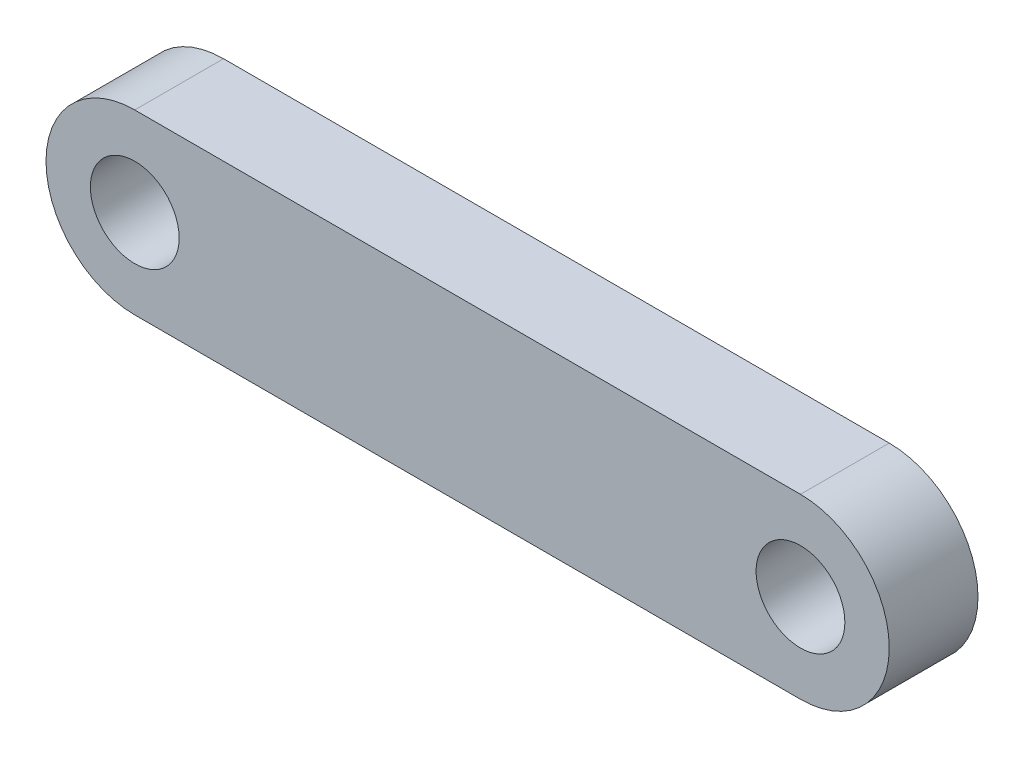
ISO-10303-21;
HEADER;
FILE_DESCRIPTION(('STEP AP214'),'2;1');
FILE_NAME('part.step','',(''),(''),'','','');
FILE_SCHEMA(('AUTOMOTIVE_DESIGN { 1 0 10303 214 1 1 1 1 }'));
ENDSEC;
DATA;
#1=APPLICATION_CONTEXT('core data for automotive mechanical design processes');
#2=APPLICATION_PROTOCOL_DEFINITION('international standard','automotive_design',2000,#1);
#3=PRODUCT_CONTEXT('',#1,'mechanical');
#4=PRODUCT('Part','Part','',(#3));
#5=PRODUCT_RELATED_PRODUCT_CATEGORY('part','',(#4));
#6=PRODUCT_DEFINITION_FORMATION('','',#4);
#7=PRODUCT_DEFINITION_CONTEXT('part definition',#1,'design');
#8=PRODUCT_DEFINITION('design','',#6,#7);
#9=PRODUCT_DEFINITION_SHAPE('','',#8);
#10=(LENGTH_UNIT() NAMED_UNIT(*) SI_UNIT(.MILLI.,.METRE.));
#11=(NAMED_UNIT(*) PLANE_ANGLE_UNIT() SI_UNIT($,.RADIAN.));
#12=(NAMED_UNIT(*) SI_UNIT($,.STERADIAN.) SOLID_ANGLE_UNIT());
#13=UNCERTAINTY_MEASURE_WITH_UNIT(LENGTH_MEASURE(1.E-05),#10,'distance_accuracy_value','');
#14=(GEOMETRIC_REPRESENTATION_CONTEXT(3) GLOBAL_UNCERTAINTY_ASSIGNED_CONTEXT((#13)) GLOBAL_UNIT_ASSIGNED_CONTEXT((#10,
#11,#12)) REPRESENTATION_CONTEXT('',''));
#15=CARTESIAN_POINT('',(0.,0.,0.));
#16=DIRECTION('',(0.,0.,1.));
#17=DIRECTION('',(1.,0.,0.));
#18=AXIS2_PLACEMENT_3D('',#15,#16,#17);
#19=CARTESIAN_POINT('',(-37.5,0.,-10.));
#20=DIRECTION('',(0.,0.,1.));
#21=DIRECTION('',(1.,0.,0.));
#22=AXIS2_PLACEMENT_3D('',#19,#20,#21);
#23=CYLINDRICAL_SURFACE('',#22,10.);
#24=CARTESIAN_POINT('',(-37.5,0.,0.));
#25=DIRECTION('',(0.,0.,1.));
#26=DIRECTION('',(1.,0.,0.));
#27=AXIS2_PLACEMENT_3D('',#24,#25,#26);
#28=CIRCLE('',#27,10.);
#29=CARTESIAN_POINT('',(-37.5,10.,0.));
#30=VERTEX_POINT('',#29);
#31=CARTESIAN_POINT('',(-37.5,-10.,0.));
#32=VERTEX_POINT('',#31);
#33=EDGE_CURVE('E98',#30,#32,#28,.T.);
#34=ORIENTED_EDGE('',*,*,#33,.F.);
#35=DIRECTION('',(0.,0.,1.));
#36=VECTOR('',#35,1.);
#37=CARTESIAN_POINT('',(-37.5,10.,-10.));
#38=LINE('',#37,#36);
#39=CARTESIAN_POINT('',(-37.5,10.,-10.));
#40=VERTEX_POINT('',#39);
#41=EDGE_CURVE('E11',#40,#30,#38,.T.);
#42=ORIENTED_EDGE('',*,*,#41,.F.);
#43=CARTESIAN_POINT('',(-37.5,0.,-10.));
#44=DIRECTION('',(0.,0.,1.));
#45=DIRECTION('',(1.,0.,0.));
#46=AXIS2_PLACEMENT_3D('',#43,#44,#45);
#47=CIRCLE('',#46,10.);
#48=CARTESIAN_POINT('',(-37.5,-10.,-10.));
#49=VERTEX_POINT('',#48);
#50=EDGE_CURVE('E91',#40,#49,#47,.T.);
#51=ORIENTED_EDGE('',*,*,#50,.T.);
#52=DIRECTION('',(0.,0.,1.));
#53=VECTOR('',#52,1.);
#54=CARTESIAN_POINT('',(-37.5,-10.,-10.));
#55=LINE('',#54,#53);
#56=EDGE_CURVE('E36',#49,#32,#55,.T.);
#57=ORIENTED_EDGE('',*,*,#56,.T.);
#58=EDGE_LOOP('',(#34,#42,#51,#57));
#59=FACE_BOUND('',#58,.T.);
#60=ADVANCED_FACE('F33',(#59),#23,.T.);
#61=CARTESIAN_POINT('',(-37.5,10.,-10.));
#62=DIRECTION('',(0.,1.,0.));
#63=DIRECTION('',(0.,0.,1.));
#64=AXIS2_PLACEMENT_3D('',#61,#62,#63);
#65=PLANE('',#64);
#66=DIRECTION('',(-1.,0.,0.));
#67=VECTOR('',#66,1.);
#68=CARTESIAN_POINT('',(-37.5,10.,0.));
#69=LINE('',#68,#67);
#70=CARTESIAN_POINT('',(37.5,10.,0.));
#71=VERTEX_POINT('',#70);
#72=EDGE_CURVE('E93',#71,#30,#69,.T.);
#73=ORIENTED_EDGE('',*,*,#72,.F.);
#74=DIRECTION('',(0.,0.,1.));
#75=VECTOR('',#74,1.);
#76=CARTESIAN_POINT('',(37.5,10.,-10.));
#77=LINE('',#76,#75);
#78=CARTESIAN_POINT('',(37.5,10.,-10.));
#79=VERTEX_POINT('',#78);
#80=EDGE_CURVE('E42',#79,#71,#77,.T.);
#81=ORIENTED_EDGE('',*,*,#80,.F.);
#82=DIRECTION('',(-1.,0.,0.));
#83=VECTOR('',#82,1.);
#84=CARTESIAN_POINT('',(-37.5,10.,-10.));
#85=LINE('',#84,#83);
#86=EDGE_CURVE('E88',#79,#40,#85,.T.);
#87=ORIENTED_EDGE('',*,*,#86,.T.);
#88=ORIENTED_EDGE('',*,*,#41,.T.);
#89=EDGE_LOOP('',(#73,#81,#87,#88));
#90=FACE_BOUND('',#89,.T.);
#91=ADVANCED_FACE('F109',(#90),#65,.T.);
#92=CARTESIAN_POINT('',(37.5,0.,-10.));
#93=DIRECTION('',(0.,0.,1.));
#94=DIRECTION('',(1.,0.,0.));
#95=AXIS2_PLACEMENT_3D('',#92,#93,#94);
#96=CYLINDRICAL_SURFACE('',#95,10.);
#97=CARTESIAN_POINT('',(37.5,0.,0.));
#98=DIRECTION('',(0.,0.,1.));
#99=DIRECTION('',(1.,0.,0.));
#100=AXIS2_PLACEMENT_3D('',#97,#98,#99);
#101=CIRCLE('',#100,10.);
#102=CARTESIAN_POINT('',(37.5,-10.,0.));
#103=VERTEX_POINT('',#102);
#104=EDGE_CURVE('E83',#103,#71,#101,.T.);
#105=ORIENTED_EDGE('',*,*,#104,.F.);
#106=DIRECTION('',(0.,0.,1.));
#107=VECTOR('',#106,1.);
#108=CARTESIAN_POINT('',(37.5,-10.,-10.));
#109=LINE('',#108,#107);
#110=CARTESIAN_POINT('',(37.5,-10.,-10.));
#111=VERTEX_POINT('',#110);
#112=EDGE_CURVE('E78',#111,#103,#109,.T.);
#113=ORIENTED_EDGE('',*,*,#112,.F.);
#114=CARTESIAN_POINT('',(37.5,0.,-10.));
#115=DIRECTION('',(0.,0.,1.));
#116=DIRECTION('',(1.,0.,0.));
#117=AXIS2_PLACEMENT_3D('',#114,#115,#116);
#118=CIRCLE('',#117,10.);
#119=EDGE_CURVE('E81',#111,#79,#118,.T.);
#120=ORIENTED_EDGE('',*,*,#119,.T.);
#121=ORIENTED_EDGE('',*,*,#80,.T.);
#122=EDGE_LOOP('',(#105,#113,#120,#121));
#123=FACE_BOUND('',#122,.T.);
#124=ADVANCED_FACE('F80',(#123),#96,.T.);
#125=CARTESIAN_POINT('',(-37.5,-10.,-10.));
#126=DIRECTION('',(0.,-1.,0.));
#127=DIRECTION('',(0.,0.,-1.));
#128=AXIS2_PLACEMENT_3D('',#125,#126,#127);
#129=PLANE('',#128);
#130=DIRECTION('',(1.,0.,0.));
#131=VECTOR('',#130,1.);
#132=CARTESIAN_POINT('',(-37.5,-10.,0.));
#133=LINE('',#132,#131);
#134=EDGE_CURVE('E101',#32,#103,#133,.T.);
#135=ORIENTED_EDGE('',*,*,#134,.F.);
#136=ORIENTED_EDGE('',*,*,#56,.F.);
#137=DIRECTION('',(1.,0.,0.));
#138=VECTOR('',#137,1.);
#139=CARTESIAN_POINT('',(-37.5,-10.,-10.));
#140=LINE('',#139,#138);
#141=EDGE_CURVE('E87',#49,#111,#140,.T.);
#142=ORIENTED_EDGE('',*,*,#141,.T.);
#143=ORIENTED_EDGE('',*,*,#112,.T.);
#144=EDGE_LOOP('',(#135,#136,#142,#143));
#145=FACE_BOUND('',#144,.T.);
#146=ADVANCED_FACE('F90',(#145),#129,.T.);
#147=CARTESIAN_POINT('',(-37.5,0.,-10.));
#148=DIRECTION('',(0.,0.,1.));
#149=DIRECTION('',(1.,0.,0.));
#150=AXIS2_PLACEMENT_3D('',#147,#148,#149);
#151=PLANE('',#150);
#152=CARTESIAN_POINT('',(37.5,0.,-10.));
#153=DIRECTION('',(0.,0.,1.));
#154=DIRECTION('',(1.,0.,0.));
#155=AXIS2_PLACEMENT_3D('',#152,#153,#154);
#156=CIRCLE('',#155,5.);
#157=CARTESIAN_POINT('',(42.5,0.,-10.));
#158=VERTEX_POINT('',#157);
#159=EDGE_CURVE('E142',#158,#158,#156,.T.);
#160=ORIENTED_EDGE('',*,*,#159,.T.);
#161=EDGE_LOOP('',(#160));
#162=FACE_BOUND('',#161,.T.);
#163=CARTESIAN_POINT('',(-37.5,0.,-10.));
#164=DIRECTION('',(0.,0.,1.));
#165=DIRECTION('',(1.,0.,0.));
#166=AXIS2_PLACEMENT_3D('',#163,#164,#165);
#167=CIRCLE('',#166,5.);
#168=CARTESIAN_POINT('',(-32.5,0.,-10.));
#169=VERTEX_POINT('',#168);
#170=EDGE_CURVE('E102',#169,#169,#167,.T.);
#171=ORIENTED_EDGE('',*,*,#170,.T.);
#172=EDGE_LOOP('',(#171));
#173=FACE_BOUND('',#172,.T.);
#174=ORIENTED_EDGE('',*,*,#50,.F.);
#175=ORIENTED_EDGE('',*,*,#86,.F.);
#176=ORIENTED_EDGE('',*,*,#119,.F.);
#177=ORIENTED_EDGE('',*,*,#141,.F.);
#178=EDGE_LOOP('',(#174,#175,#176,#177));
#179=FACE_BOUND('',#178,.T.);
#180=ADVANCED_FACE('F86',(#162,#173,#179),#151,.F.);
#181=CARTESIAN_POINT('',(-37.5,0.,0.));
#182=DIRECTION('',(0.,0.,1.));
#183=DIRECTION('',(1.,0.,0.));
#184=AXIS2_PLACEMENT_3D('',#181,#182,#183);
#185=PLANE('',#184);
#186=CARTESIAN_POINT('',(37.5,0.,0.));
#187=DIRECTION('',(0.,0.,1.));
#188=DIRECTION('',(1.,0.,0.));
#189=AXIS2_PLACEMENT_3D('',#186,#187,#188);
#190=CIRCLE('',#189,5.);
#191=CARTESIAN_POINT('',(42.5,0.,0.));
#192=VERTEX_POINT('',#191);
#193=EDGE_CURVE('E145',#192,#192,#190,.T.);
#194=ORIENTED_EDGE('',*,*,#193,.F.);
#195=EDGE_LOOP('',(#194));
#196=FACE_BOUND('',#195,.T.);
#197=CARTESIAN_POINT('',(-37.5,0.,0.));
#198=DIRECTION('',(0.,0.,1.));
#199=DIRECTION('',(1.,0.,0.));
#200=AXIS2_PLACEMENT_3D('',#197,#198,#199);
#201=CIRCLE('',#200,5.);
#202=CARTESIAN_POINT('',(-32.5,0.,0.));
#203=VERTEX_POINT('',#202);
#204=EDGE_CURVE('E147',#203,#203,#201,.T.);
#205=ORIENTED_EDGE('',*,*,#204,.F.);
#206=EDGE_LOOP('',(#205));
#207=FACE_BOUND('',#206,.T.);
#208=ORIENTED_EDGE('',*,*,#33,.T.);
#209=ORIENTED_EDGE('',*,*,#134,.T.);
#210=ORIENTED_EDGE('',*,*,#104,.T.);
#211=ORIENTED_EDGE('',*,*,#72,.T.);
#212=EDGE_LOOP('',(#208,#209,#210,#211));
#213=FACE_BOUND('',#212,.T.);
#214=ADVANCED_FACE('F108',(#196,#207,#213),#185,.T.);
#215=CARTESIAN_POINT('',(-37.5,0.,-10.));
#216=DIRECTION('',(0.,0.,1.));
#217=DIRECTION('',(1.,0.,0.));
#218=AXIS2_PLACEMENT_3D('',#215,#216,#217);
#219=CYLINDRICAL_SURFACE('',#218,5.);
#220=ORIENTED_EDGE('',*,*,#170,.F.);
#221=EDGE_LOOP('',(#220));
#222=FACE_BOUND('',#221,.T.);
#223=ORIENTED_EDGE('',*,*,#204,.T.);
#224=EDGE_LOOP('',(#223));
#225=FACE_BOUND('',#224,.T.);
#226=ADVANCED_FACE('F127',(#222,#225),#219,.F.);
#227=CARTESIAN_POINT('',(37.5,0.,-10.));
#228=DIRECTION('',(0.,0.,1.));
#229=DIRECTION('',(1.,0.,0.));
#230=AXIS2_PLACEMENT_3D('',#227,#228,#229);
#231=CYLINDRICAL_SURFACE('',#230,5.);
#232=ORIENTED_EDGE('',*,*,#159,.F.);
#233=EDGE_LOOP('',(#232));
#234=FACE_BOUND('',#233,.T.);
#235=ORIENTED_EDGE('',*,*,#193,.T.);
#236=EDGE_LOOP('',(#235));
#237=FACE_BOUND('',#236,.T.);
#238=ADVANCED_FACE('F134',(#234,#237),#231,.F.);
#239=CLOSED_SHELL('',(#60,#91,#124,#146,#180,#214,#226,#238));
#240=MANIFOLD_SOLID_BREP('B2',#239);
#241=ADVANCED_BREP_SHAPE_REPRESENTATION('',(#18,#240),#14);
#242=SHAPE_DEFINITION_REPRESENTATION(#9,#241);
ENDSEC;
END-ISO-10303-21;
